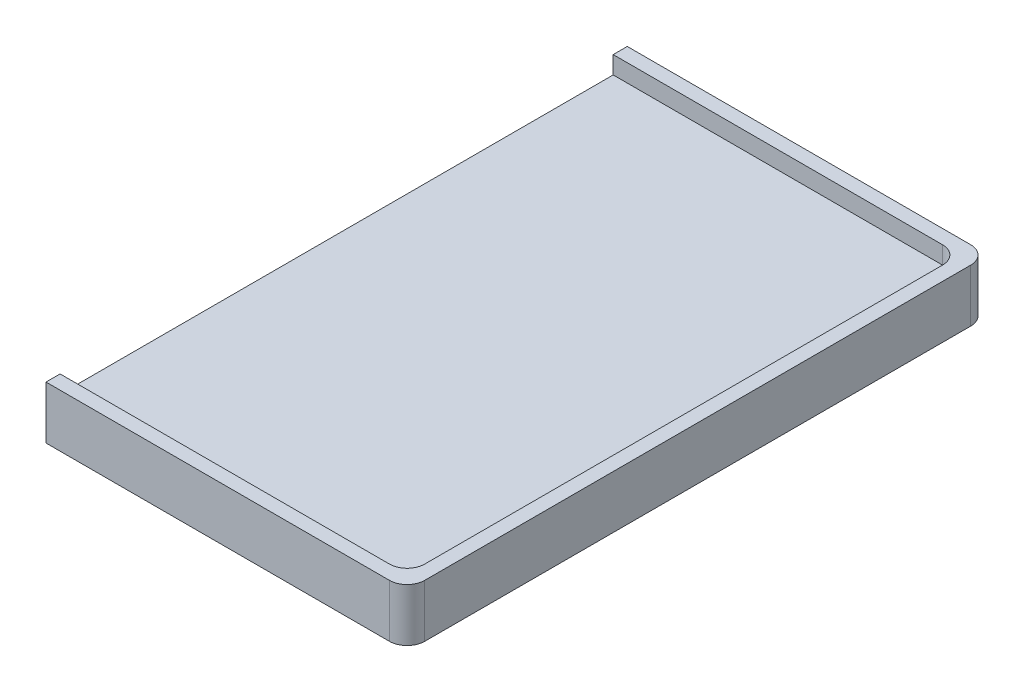
ISO-10303-21;
HEADER;
FILE_DESCRIPTION(('STEP AP214'),'2;1');
FILE_NAME('part.step','',(''),(''),'','','');
FILE_SCHEMA(('AUTOMOTIVE_DESIGN { 1 0 10303 214 1 1 1 1 }'));
ENDSEC;
DATA;
#1=APPLICATION_CONTEXT('core data for automotive mechanical design processes');
#2=APPLICATION_PROTOCOL_DEFINITION('international standard','automotive_design',2000,#1);
#3=PRODUCT_CONTEXT('',#1,'mechanical');
#4=PRODUCT('Part','Part','',(#3));
#5=PRODUCT_RELATED_PRODUCT_CATEGORY('part','',(#4));
#6=PRODUCT_DEFINITION_FORMATION('','',#4);
#7=PRODUCT_DEFINITION_CONTEXT('part definition',#1,'design');
#8=PRODUCT_DEFINITION('design','',#6,#7);
#9=PRODUCT_DEFINITION_SHAPE('','',#8);
#10=(LENGTH_UNIT() NAMED_UNIT(*) SI_UNIT(.MILLI.,.METRE.));
#11=(NAMED_UNIT(*) PLANE_ANGLE_UNIT() SI_UNIT($,.RADIAN.));
#12=(NAMED_UNIT(*) SI_UNIT($,.STERADIAN.) SOLID_ANGLE_UNIT());
#13=UNCERTAINTY_MEASURE_WITH_UNIT(LENGTH_MEASURE(1.E-05),#10,'distance_accuracy_value','');
#14=(GEOMETRIC_REPRESENTATION_CONTEXT(3) GLOBAL_UNCERTAINTY_ASSIGNED_CONTEXT((#13)) GLOBAL_UNIT_ASSIGNED_CONTEXT((#10,
#11,#12)) REPRESENTATION_CONTEXT('',''));
#15=CARTESIAN_POINT('',(0.,0.,0.));
#16=DIRECTION('',(0.,0.,1.));
#17=DIRECTION('',(1.,0.,0.));
#18=AXIS2_PLACEMENT_3D('',#15,#16,#17);
#19=CARTESIAN_POINT('',(125.,0.,0.));
#20=DIRECTION('',(-1.,0.,0.));
#21=DIRECTION('',(0.,0.,1.));
#22=AXIS2_PLACEMENT_3D('',#19,#20,#21);
#23=PLANE('',#22);
#24=DIRECTION('',(0.,0.,-1.));
#25=VECTOR('',#24,1.);
#26=CARTESIAN_POINT('',(125.,0.,0.));
#27=LINE('',#26,#25);
#28=CARTESIAN_POINT('',(125.,0.,0.));
#29=VERTEX_POINT('',#28);
#30=CARTESIAN_POINT('',(125.,0.,-330.));
#31=VERTEX_POINT('',#30);
#32=EDGE_CURVE('E182',#29,#31,#27,.T.);
#33=ORIENTED_EDGE('',*,*,#32,.F.);
#34=DIRECTION('',(0.,1.,0.));
#35=VECTOR('',#34,1.);
#36=CARTESIAN_POINT('',(125.,30.,0.));
#37=LINE('',#36,#35);
#38=CARTESIAN_POINT('',(125.,30.,0.));
#39=VERTEX_POINT('',#38);
#40=EDGE_CURVE('E136',#29,#39,#37,.T.);
#41=ORIENTED_EDGE('',*,*,#40,.T.);
#42=DIRECTION('',(0.,0.,-1.));
#43=VECTOR('',#42,1.);
#44=CARTESIAN_POINT('',(125.,30.,0.));
#45=LINE('',#44,#43);
#46=CARTESIAN_POINT('',(125.,30.,-8.00000000000001));
#47=VERTEX_POINT('',#46);
#48=EDGE_CURVE('E123',#39,#47,#45,.T.);
#49=ORIENTED_EDGE('',*,*,#48,.T.);
#50=DIRECTION('',(0.,-1.,0.));
#51=VECTOR('',#50,1.);
#52=CARTESIAN_POINT('',(125.,20.,-8.00000000000001));
#53=LINE('',#52,#51);
#54=CARTESIAN_POINT('',(125.,20.,-8.00000000000001));
#55=VERTEX_POINT('',#54);
#56=EDGE_CURVE('E133',#47,#55,#53,.T.);
#57=ORIENTED_EDGE('',*,*,#56,.T.);
#58=DIRECTION('',(0.,0.,1.));
#59=VECTOR('',#58,1.);
#60=CARTESIAN_POINT('',(125.,20.,0.));
#61=LINE('',#60,#59);
#62=CARTESIAN_POINT('',(125.,20.,-322.));
#63=VERTEX_POINT('',#62);
#64=EDGE_CURVE('E179',#63,#55,#61,.T.);
#65=ORIENTED_EDGE('',*,*,#64,.F.);
#66=DIRECTION('',(0.,1.,0.));
#67=VECTOR('',#66,1.);
#68=CARTESIAN_POINT('',(125.,20.,-322.));
#69=LINE('',#68,#67);
#70=CARTESIAN_POINT('',(125.,30.,-322.));
#71=VERTEX_POINT('',#70);
#72=EDGE_CURVE('E142',#63,#71,#69,.T.);
#73=ORIENTED_EDGE('',*,*,#72,.T.);
#74=CARTESIAN_POINT('',(125.,30.,-330.));
#75=VERTEX_POINT('',#74);
#76=EDGE_CURVE('E138',#71,#75,#45,.T.);
#77=ORIENTED_EDGE('',*,*,#76,.T.);
#78=DIRECTION('',(0.,-1.,0.));
#79=VECTOR('',#78,1.);
#80=CARTESIAN_POINT('',(125.,30.,-330.));
#81=LINE('',#80,#79);
#82=EDGE_CURVE('E137',#75,#31,#81,.T.);
#83=ORIENTED_EDGE('',*,*,#82,.T.);
#84=EDGE_LOOP('',(#33,#41,#49,#57,#65,#73,#77,#83));
#85=FACE_BOUND('',#84,.T.);
#86=ADVANCED_FACE('F32',(#85),#23,.T.);
#87=CARTESIAN_POINT('',(320.,30.,-10.));
#88=DIRECTION('',(0.,-1.,0.));
#89=DIRECTION('',(0.,0.,-1.));
#90=AXIS2_PLACEMENT_3D('',#87,#88,#89);
#91=CYLINDRICAL_SURFACE('',#90,10.);
#92=CARTESIAN_POINT('',(320.,30.,-10.));
#93=DIRECTION('',(0.,-1.,0.));
#94=DIRECTION('',(0.,0.,-1.));
#95=AXIS2_PLACEMENT_3D('',#92,#93,#94);
#96=CIRCLE('',#95,10.);
#97=CARTESIAN_POINT('',(320.,30.,0.));
#98=VERTEX_POINT('',#97);
#99=CARTESIAN_POINT('',(330.,30.,-10.));
#100=VERTEX_POINT('',#99);
#101=EDGE_CURVE('E203',#98,#100,#96,.F.);
#102=ORIENTED_EDGE('',*,*,#101,.F.);
#103=DIRECTION('',(0.,-1.,0.));
#104=VECTOR('',#103,1.);
#105=CARTESIAN_POINT('',(320.,30.,0.));
#106=LINE('',#105,#104);
#107=CARTESIAN_POINT('',(320.,0.,0.));
#108=VERTEX_POINT('',#107);
#109=EDGE_CURVE('E201',#108,#98,#106,.F.);
#110=ORIENTED_EDGE('',*,*,#109,.F.);
#111=CARTESIAN_POINT('',(320.,0.,-10.));
#112=DIRECTION('',(0.,-1.,0.));
#113=DIRECTION('',(0.,0.,-1.));
#114=AXIS2_PLACEMENT_3D('',#111,#112,#113);
#115=CIRCLE('',#114,10.);
#116=CARTESIAN_POINT('',(330.,0.,-10.));
#117=VERTEX_POINT('',#116);
#118=EDGE_CURVE('E214',#117,#108,#115,.T.);
#119=ORIENTED_EDGE('',*,*,#118,.F.);
#120=DIRECTION('',(0.,-1.,0.));
#121=VECTOR('',#120,1.);
#122=CARTESIAN_POINT('',(330.,30.,-10.));
#123=LINE('',#122,#121);
#124=EDGE_CURVE('E212',#100,#117,#123,.T.);
#125=ORIENTED_EDGE('',*,*,#124,.F.);
#126=EDGE_LOOP('',(#102,#110,#119,#125));
#127=FACE_BOUND('',#126,.T.);
#128=ADVANCED_FACE('F213',(#127),#91,.T.);
#129=CARTESIAN_POINT('',(330.,30.,0.));
#130=DIRECTION('',(-1.,0.,0.));
#131=DIRECTION('',(0.,0.,1.));
#132=AXIS2_PLACEMENT_3D('',#129,#130,#131);
#133=PLANE('',#132);
#134=DIRECTION('',(0.,0.,-1.));
#135=VECTOR('',#134,1.);
#136=CARTESIAN_POINT('',(330.,0.,0.));
#137=LINE('',#136,#135);
#138=CARTESIAN_POINT('',(330.,0.,-320.));
#139=VERTEX_POINT('',#138);
#140=EDGE_CURVE('E156',#117,#139,#137,.T.);
#141=ORIENTED_EDGE('',*,*,#140,.T.);
#142=DIRECTION('',(0.,-1.,0.));
#143=VECTOR('',#142,1.);
#144=CARTESIAN_POINT('',(330.,30.,-320.));
#145=LINE('',#144,#143);
#146=CARTESIAN_POINT('',(330.,30.,-320.));
#147=VERTEX_POINT('',#146);
#148=EDGE_CURVE('E207',#139,#147,#145,.F.);
#149=ORIENTED_EDGE('',*,*,#148,.T.);
#150=DIRECTION('',(0.,0.,-1.));
#151=VECTOR('',#150,1.);
#152=CARTESIAN_POINT('',(330.,30.,0.));
#153=LINE('',#152,#151);
#154=EDGE_CURVE('E149',#100,#147,#153,.T.);
#155=ORIENTED_EDGE('',*,*,#154,.F.);
#156=ORIENTED_EDGE('',*,*,#124,.T.);
#157=EDGE_LOOP('',(#141,#149,#155,#156));
#158=FACE_BOUND('',#157,.T.);
#159=ADVANCED_FACE('F211',(#158),#133,.F.);
#160=CARTESIAN_POINT('',(320.,30.,-320.));
#161=DIRECTION('',(0.,-1.,0.));
#162=DIRECTION('',(0.,0.,-1.));
#163=AXIS2_PLACEMENT_3D('',#160,#161,#162);
#164=CYLINDRICAL_SURFACE('',#163,10.);
#165=CARTESIAN_POINT('',(320.,30.,-320.));
#166=DIRECTION('',(0.,-1.,0.));
#167=DIRECTION('',(0.,0.,-1.));
#168=AXIS2_PLACEMENT_3D('',#165,#166,#167);
#169=CIRCLE('',#168,10.);
#170=CARTESIAN_POINT('',(320.,30.,-330.));
#171=VERTEX_POINT('',#170);
#172=EDGE_CURVE('E55',#147,#171,#169,.F.);
#173=ORIENTED_EDGE('',*,*,#172,.F.);
#174=ORIENTED_EDGE('',*,*,#148,.F.);
#175=CARTESIAN_POINT('',(320.,0.,-320.));
#176=DIRECTION('',(0.,-1.,0.));
#177=DIRECTION('',(0.,0.,-1.));
#178=AXIS2_PLACEMENT_3D('',#175,#176,#177);
#179=CIRCLE('',#178,10.);
#180=CARTESIAN_POINT('',(320.,0.,-330.));
#181=VERTEX_POINT('',#180);
#182=EDGE_CURVE('E47',#181,#139,#179,.T.);
#183=ORIENTED_EDGE('',*,*,#182,.F.);
#184=DIRECTION('',(0.,-1.,0.));
#185=VECTOR('',#184,1.);
#186=CARTESIAN_POINT('',(320.,30.,-330.));
#187=LINE('',#186,#185);
#188=EDGE_CURVE('E150',#171,#181,#187,.T.);
#189=ORIENTED_EDGE('',*,*,#188,.F.);
#190=EDGE_LOOP('',(#173,#174,#183,#189));
#191=FACE_BOUND('',#190,.T.);
#192=ADVANCED_FACE('F220',(#191),#164,.T.);
#193=CARTESIAN_POINT('',(0.,30.,-330.));
#194=DIRECTION('',(0.,0.,1.));
#195=DIRECTION('',(1.,0.,0.));
#196=AXIS2_PLACEMENT_3D('',#193,#194,#195);
#197=PLANE('',#196);
#198=ORIENTED_EDGE('',*,*,#82,.F.);
#199=DIRECTION('',(-1.,0.,0.));
#200=VECTOR('',#199,1.);
#201=CARTESIAN_POINT('',(0.,30.,-330.));
#202=LINE('',#201,#200);
#203=EDGE_CURVE('E147',#171,#75,#202,.T.);
#204=ORIENTED_EDGE('',*,*,#203,.F.);
#205=ORIENTED_EDGE('',*,*,#188,.T.);
#206=DIRECTION('',(-1.,0.,0.));
#207=VECTOR('',#206,1.);
#208=CARTESIAN_POINT('',(0.,0.,-330.));
#209=LINE('',#208,#207);
#210=EDGE_CURVE('E153',#181,#31,#209,.T.);
#211=ORIENTED_EDGE('',*,*,#210,.T.);
#212=EDGE_LOOP('',(#198,#204,#205,#211));
#213=FACE_BOUND('',#212,.T.);
#214=ADVANCED_FACE('F189',(#213),#197,.F.);
#215=CARTESIAN_POINT('',(0.,30.,0.));
#216=DIRECTION('',(0.,0.,-1.));
#217=DIRECTION('',(-1.,0.,0.));
#218=AXIS2_PLACEMENT_3D('',#215,#216,#217);
#219=PLANE('',#218);
#220=ORIENTED_EDGE('',*,*,#40,.F.);
#221=DIRECTION('',(1.,0.,0.));
#222=VECTOR('',#221,1.);
#223=CARTESIAN_POINT('',(0.,0.,0.));
#224=LINE('',#223,#222);
#225=EDGE_CURVE('E157',#29,#108,#224,.T.);
#226=ORIENTED_EDGE('',*,*,#225,.T.);
#227=ORIENTED_EDGE('',*,*,#109,.T.);
#228=DIRECTION('',(1.,0.,0.));
#229=VECTOR('',#228,1.);
#230=CARTESIAN_POINT('',(0.,30.,0.));
#231=LINE('',#230,#229);
#232=EDGE_CURVE('E151',#39,#98,#231,.T.);
#233=ORIENTED_EDGE('',*,*,#232,.F.);
#234=EDGE_LOOP('',(#220,#226,#227,#233));
#235=FACE_BOUND('',#234,.T.);
#236=ADVANCED_FACE('F198',(#235),#219,.F.);
#237=CARTESIAN_POINT('',(0.,0.,0.));
#238=DIRECTION('',(0.,-1.,0.));
#239=DIRECTION('',(0.,0.,-1.));
#240=AXIS2_PLACEMENT_3D('',#237,#238,#239);
#241=PLANE('',#240);
#242=ORIENTED_EDGE('',*,*,#225,.F.);
#243=ORIENTED_EDGE('',*,*,#32,.T.);
#244=ORIENTED_EDGE('',*,*,#210,.F.);
#245=ORIENTED_EDGE('',*,*,#182,.T.);
#246=ORIENTED_EDGE('',*,*,#140,.F.);
#247=ORIENTED_EDGE('',*,*,#118,.T.);
#248=EDGE_LOOP('',(#242,#243,#244,#245,#246,#247));
#249=FACE_BOUND('',#248,.T.);
#250=ADVANCED_FACE('F193',(#249),#241,.T.);
#251=CARTESIAN_POINT('',(0.,30.,0.));
#252=DIRECTION('',(0.,-1.,0.));
#253=DIRECTION('',(0.,0.,-1.));
#254=AXIS2_PLACEMENT_3D('',#251,#252,#253);
#255=PLANE('',#254);
#256=ORIENTED_EDGE('',*,*,#48,.F.);
#257=ORIENTED_EDGE('',*,*,#232,.T.);
#258=ORIENTED_EDGE('',*,*,#101,.T.);
#259=ORIENTED_EDGE('',*,*,#154,.T.);
#260=ORIENTED_EDGE('',*,*,#172,.T.);
#261=ORIENTED_EDGE('',*,*,#203,.T.);
#262=ORIENTED_EDGE('',*,*,#76,.F.);
#263=DIRECTION('',(-1.,0.,0.));
#264=VECTOR('',#263,1.);
#265=CARTESIAN_POINT('',(8.00000000000001,30.,-322.));
#266=LINE('',#265,#264);
#267=CARTESIAN_POINT('',(312.,30.,-322.));
#268=VERTEX_POINT('',#267);
#269=EDGE_CURVE('E163',#268,#71,#266,.T.);
#270=ORIENTED_EDGE('',*,*,#269,.F.);
#271=CARTESIAN_POINT('',(312.,30.,-312.));
#272=DIRECTION('',(0.,-1.,0.));
#273=DIRECTION('',(0.,0.,-1.));
#274=AXIS2_PLACEMENT_3D('',#271,#272,#273);
#275=CIRCLE('',#274,10.);
#276=CARTESIAN_POINT('',(322.,30.,-312.));
#277=VERTEX_POINT('',#276);
#278=EDGE_CURVE('E181',#268,#277,#275,.T.);
#279=ORIENTED_EDGE('',*,*,#278,.T.);
#280=DIRECTION('',(0.,0.,-1.));
#281=VECTOR('',#280,1.);
#282=CARTESIAN_POINT('',(322.,30.,-322.));
#283=LINE('',#282,#281);
#284=CARTESIAN_POINT('',(322.,30.,-18.));
#285=VERTEX_POINT('',#284);
#286=EDGE_CURVE('E40',#285,#277,#283,.T.);
#287=ORIENTED_EDGE('',*,*,#286,.F.);
#288=CARTESIAN_POINT('',(312.,30.,-18.));
#289=DIRECTION('',(0.,-1.,0.));
#290=DIRECTION('',(0.,0.,-1.));
#291=AXIS2_PLACEMENT_3D('',#288,#289,#290);
#292=CIRCLE('',#291,10.);
#293=CARTESIAN_POINT('',(312.,30.,-8.00000000000001));
#294=VERTEX_POINT('',#293);
#295=EDGE_CURVE('E125',#285,#294,#292,.T.);
#296=ORIENTED_EDGE('',*,*,#295,.T.);
#297=DIRECTION('',(1.,0.,0.));
#298=VECTOR('',#297,1.);
#299=CARTESIAN_POINT('',(8.00000000000004,30.,-8.00000000000001));
#300=LINE('',#299,#298);
#301=EDGE_CURVE('E11',#47,#294,#300,.T.);
#302=ORIENTED_EDGE('',*,*,#301,.F.);
#303=EDGE_LOOP('',(#256,#257,#258,#259,#260,#261,#262,#270,#279,#287,#296,#302));
#304=FACE_BOUND('',#303,.T.);
#305=ADVANCED_FACE('F122',(#304),#255,.F.);
#306=CARTESIAN_POINT('',(312.,20.,-312.));
#307=DIRECTION('',(0.,-1.,0.));
#308=DIRECTION('',(0.,0.,-1.));
#309=AXIS2_PLACEMENT_3D('',#306,#307,#308);
#310=CYLINDRICAL_SURFACE('',#309,10.);
#311=CARTESIAN_POINT('',(312.,20.,-312.));
#312=DIRECTION('',(0.,1.,0.));
#313=DIRECTION('',(0.,0.,1.));
#314=AXIS2_PLACEMENT_3D('',#311,#312,#313);
#315=CIRCLE('',#314,10.);
#316=CARTESIAN_POINT('',(322.,20.,-312.));
#317=VERTEX_POINT('',#316);
#318=CARTESIAN_POINT('',(312.,20.,-322.));
#319=VERTEX_POINT('',#318);
#320=EDGE_CURVE('E226',#317,#319,#315,.T.);
#321=ORIENTED_EDGE('',*,*,#320,.F.);
#322=DIRECTION('',(0.,1.,0.));
#323=VECTOR('',#322,1.);
#324=CARTESIAN_POINT('',(322.,20.,-312.));
#325=LINE('',#324,#323);
#326=EDGE_CURVE('E230',#277,#317,#325,.F.);
#327=ORIENTED_EDGE('',*,*,#326,.F.);
#328=ORIENTED_EDGE('',*,*,#278,.F.);
#329=DIRECTION('',(0.,1.,0.));
#330=VECTOR('',#329,1.);
#331=CARTESIAN_POINT('',(312.,30.,-322.));
#332=LINE('',#331,#330);
#333=EDGE_CURVE('E234',#319,#268,#332,.T.);
#334=ORIENTED_EDGE('',*,*,#333,.F.);
#335=EDGE_LOOP('',(#321,#327,#328,#334));
#336=FACE_BOUND('',#335,.T.);
#337=ADVANCED_FACE('F240',(#336),#310,.F.);
#338=CARTESIAN_POINT('',(322.,20.,-322.));
#339=DIRECTION('',(1.,0.,0.));
#340=DIRECTION('',(0.,0.,-1.));
#341=AXIS2_PLACEMENT_3D('',#338,#339,#340);
#342=PLANE('',#341);
#343=DIRECTION('',(0.,0.,-1.));
#344=VECTOR('',#343,1.);
#345=CARTESIAN_POINT('',(322.,20.,-322.));
#346=LINE('',#345,#344);
#347=CARTESIAN_POINT('',(322.,20.,-18.));
#348=VERTEX_POINT('',#347);
#349=EDGE_CURVE('E162',#348,#317,#346,.T.);
#350=ORIENTED_EDGE('',*,*,#349,.F.);
#351=DIRECTION('',(0.,1.,0.));
#352=VECTOR('',#351,1.);
#353=CARTESIAN_POINT('',(322.,30.,-18.));
#354=LINE('',#353,#352);
#355=EDGE_CURVE('E232',#348,#285,#354,.T.);
#356=ORIENTED_EDGE('',*,*,#355,.T.);
#357=ORIENTED_EDGE('',*,*,#286,.T.);
#358=ORIENTED_EDGE('',*,*,#326,.T.);
#359=EDGE_LOOP('',(#350,#356,#357,#358));
#360=FACE_BOUND('',#359,.T.);
#361=ADVANCED_FACE('F247',(#360),#342,.F.);
#362=CARTESIAN_POINT('',(312.,20.,-18.));
#363=DIRECTION('',(0.,-1.,0.));
#364=DIRECTION('',(0.,0.,-1.));
#365=AXIS2_PLACEMENT_3D('',#362,#363,#364);
#366=CYLINDRICAL_SURFACE('',#365,10.);
#367=CARTESIAN_POINT('',(312.,20.,-18.));
#368=DIRECTION('',(0.,1.,0.));
#369=DIRECTION('',(0.,0.,1.));
#370=AXIS2_PLACEMENT_3D('',#367,#368,#369);
#371=CIRCLE('',#370,10.);
#372=CARTESIAN_POINT('',(312.,20.,-8.00000000000001));
#373=VERTEX_POINT('',#372);
#374=EDGE_CURVE('E228',#373,#348,#371,.T.);
#375=ORIENTED_EDGE('',*,*,#374,.F.);
#376=DIRECTION('',(0.,1.,0.));
#377=VECTOR('',#376,1.);
#378=CARTESIAN_POINT('',(312.,20.,-8.00000000000001));
#379=LINE('',#378,#377);
#380=EDGE_CURVE('E222',#294,#373,#379,.F.);
#381=ORIENTED_EDGE('',*,*,#380,.F.);
#382=ORIENTED_EDGE('',*,*,#295,.F.);
#383=ORIENTED_EDGE('',*,*,#355,.F.);
#384=EDGE_LOOP('',(#375,#381,#382,#383));
#385=FACE_BOUND('',#384,.T.);
#386=ADVANCED_FACE('F249',(#385),#366,.F.);
#387=CARTESIAN_POINT('',(8.00000000000004,20.,-8.00000000000001));
#388=DIRECTION('',(0.,0.,1.));
#389=DIRECTION('',(1.,0.,0.));
#390=AXIS2_PLACEMENT_3D('',#387,#388,#389);
#391=PLANE('',#390);
#392=ORIENTED_EDGE('',*,*,#56,.F.);
#393=ORIENTED_EDGE('',*,*,#301,.T.);
#394=ORIENTED_EDGE('',*,*,#380,.T.);
#395=DIRECTION('',(1.,0.,0.));
#396=VECTOR('',#395,1.);
#397=CARTESIAN_POINT('',(8.00000000000004,20.,-8.00000000000001));
#398=LINE('',#397,#396);
#399=EDGE_CURVE('E141',#55,#373,#398,.T.);
#400=ORIENTED_EDGE('',*,*,#399,.F.);
#401=EDGE_LOOP('',(#392,#393,#394,#400));
#402=FACE_BOUND('',#401,.T.);
#403=ADVANCED_FACE('F140',(#402),#391,.F.);
#404=CARTESIAN_POINT('',(8.00000000000001,20.,-322.));
#405=DIRECTION('',(0.,0.,-1.));
#406=DIRECTION('',(-1.,0.,0.));
#407=AXIS2_PLACEMENT_3D('',#404,#405,#406);
#408=PLANE('',#407);
#409=ORIENTED_EDGE('',*,*,#72,.F.);
#410=DIRECTION('',(-1.,0.,0.));
#411=VECTOR('',#410,1.);
#412=CARTESIAN_POINT('',(8.00000000000001,20.,-322.));
#413=LINE('',#412,#411);
#414=EDGE_CURVE('E159',#319,#63,#413,.T.);
#415=ORIENTED_EDGE('',*,*,#414,.F.);
#416=ORIENTED_EDGE('',*,*,#333,.T.);
#417=ORIENTED_EDGE('',*,*,#269,.T.);
#418=EDGE_LOOP('',(#409,#415,#416,#417));
#419=FACE_BOUND('',#418,.T.);
#420=ADVANCED_FACE('F242',(#419),#408,.F.);
#421=CARTESIAN_POINT('',(0.,20.,0.));
#422=DIRECTION('',(0.,1.,0.));
#423=DIRECTION('',(0.,0.,1.));
#424=AXIS2_PLACEMENT_3D('',#421,#422,#423);
#425=PLANE('',#424);
#426=ORIENTED_EDGE('',*,*,#414,.T.);
#427=ORIENTED_EDGE('',*,*,#64,.T.);
#428=ORIENTED_EDGE('',*,*,#399,.T.);
#429=ORIENTED_EDGE('',*,*,#374,.T.);
#430=ORIENTED_EDGE('',*,*,#349,.T.);
#431=ORIENTED_EDGE('',*,*,#320,.T.);
#432=EDGE_LOOP('',(#426,#427,#428,#429,#430,#431));
#433=FACE_BOUND('',#432,.T.);
#434=ADVANCED_FACE('F34',(#433),#425,.T.);
#435=CLOSED_SHELL('',(#86,#128,#159,#192,#214,#236,#250,#305,#337,#361,#386,#403,#420,#434));
#436=MANIFOLD_SOLID_BREP('B2',#435);
#437=ADVANCED_BREP_SHAPE_REPRESENTATION('',(#18,#436),#14);
#438=SHAPE_DEFINITION_REPRESENTATION(#9,#437);
ENDSEC;
END-ISO-10303-21;
